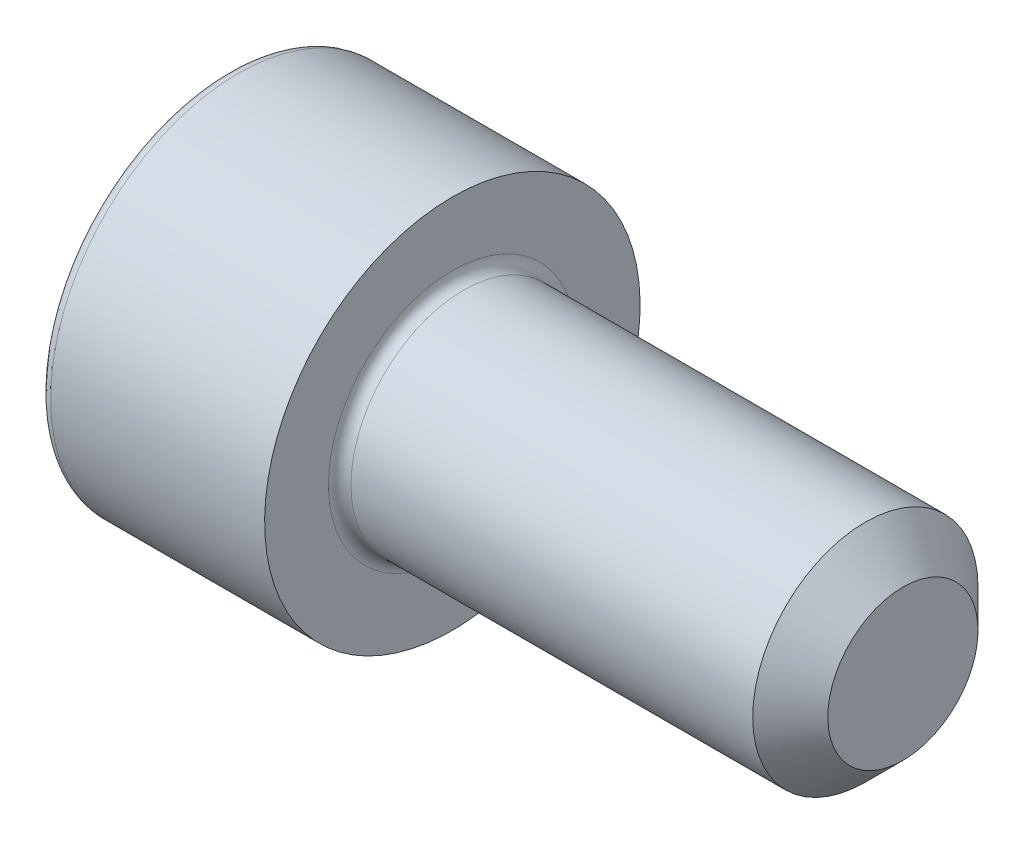
ISO-10303-21;
HEADER;
FILE_DESCRIPTION(('STEP AP214'),'2;1');
FILE_NAME('part.step','',(''),(''),'','','');
FILE_SCHEMA(('AUTOMOTIVE_DESIGN { 1 0 10303 214 1 1 1 1 }'));
ENDSEC;
DATA;
#1=APPLICATION_CONTEXT('core data for automotive mechanical design processes');
#2=APPLICATION_PROTOCOL_DEFINITION('international standard','automotive_design',2000,#1);
#3=PRODUCT_CONTEXT('',#1,'mechanical');
#4=PRODUCT('Part','Part','',(#3));
#5=PRODUCT_RELATED_PRODUCT_CATEGORY('part','',(#4));
#6=PRODUCT_DEFINITION_FORMATION('','',#4);
#7=PRODUCT_DEFINITION_CONTEXT('part definition',#1,'design');
#8=PRODUCT_DEFINITION('design','',#6,#7);
#9=PRODUCT_DEFINITION_SHAPE('','',#8);
#10=(LENGTH_UNIT() NAMED_UNIT(*) SI_UNIT(.MILLI.,.METRE.));
#11=(NAMED_UNIT(*) PLANE_ANGLE_UNIT() SI_UNIT($,.RADIAN.));
#12=(NAMED_UNIT(*) SI_UNIT($,.STERADIAN.) SOLID_ANGLE_UNIT());
#13=UNCERTAINTY_MEASURE_WITH_UNIT(LENGTH_MEASURE(1.E-05),#10,'distance_accuracy_value','');
#14=(GEOMETRIC_REPRESENTATION_CONTEXT(3) GLOBAL_UNCERTAINTY_ASSIGNED_CONTEXT((#13)) GLOBAL_UNIT_ASSIGNED_CONTEXT((#10,
#11,#12)) REPRESENTATION_CONTEXT('',''));
#15=CARTESIAN_POINT('',(0.,0.,0.));
#16=DIRECTION('',(0.,0.,1.));
#17=DIRECTION('',(1.,0.,0.));
#18=AXIS2_PLACEMENT_3D('',#15,#16,#17);
#19=CARTESIAN_POINT('',(0.,0.,0.));
#20=DIRECTION('',(-1.,0.,0.));
#21=DIRECTION('',(0.,-1.,0.));
#22=AXIS2_PLACEMENT_3D('',#19,#20,#21);
#23=PLANE('',#22);
#24=CARTESIAN_POINT('',(0.,0.,0.));
#25=DIRECTION('',(-1.,0.,0.));
#26=DIRECTION('',(0.,-1.,0.));
#27=AXIS2_PLACEMENT_3D('',#24,#25,#26);
#28=CIRCLE('',#27,4.7);
#29=CARTESIAN_POINT('',(0.,-4.7,0.));
#30=VERTEX_POINT('',#29);
#31=EDGE_CURVE('E158',#30,#30,#28,.T.);
#32=ORIENTED_EDGE('',*,*,#31,.T.);
#33=EDGE_LOOP('',(#32));
#34=FACE_BOUND('',#33,.T.);
#35=DIRECTION('',(0.,0.,-1.));
#36=VECTOR('',#35,1.);
#37=CARTESIAN_POINT('',(0.,2.5,1.44337567297407));
#38=LINE('',#37,#36);
#39=CARTESIAN_POINT('',(0.,2.5,1.44337567297407));
#40=VERTEX_POINT('',#39);
#41=CARTESIAN_POINT('',(0.,2.5,-1.44337567297406));
#42=VERTEX_POINT('',#41);
#43=EDGE_CURVE('E54',#40,#42,#38,.T.);
#44=ORIENTED_EDGE('',*,*,#43,.F.);
#45=DIRECTION('',(0.,0.866025403784439,-0.5));
#46=VECTOR('',#45,1.);
#47=CARTESIAN_POINT('',(0.,0.,2.88675134594813));
#48=LINE('',#47,#46);
#49=CARTESIAN_POINT('',(0.,0.,2.88675134594813));
#50=VERTEX_POINT('',#49);
#51=EDGE_CURVE('E137',#50,#40,#48,.T.);
#52=ORIENTED_EDGE('',*,*,#51,.F.);
#53=DIRECTION('',(0.,0.866025403784439,0.5));
#54=VECTOR('',#53,1.);
#55=CARTESIAN_POINT('',(0.,-2.5,1.44337567297406));
#56=LINE('',#55,#54);
#57=CARTESIAN_POINT('',(0.,-2.5,1.44337567297406));
#58=VERTEX_POINT('',#57);
#59=EDGE_CURVE('E135',#58,#50,#56,.T.);
#60=ORIENTED_EDGE('',*,*,#59,.F.);
#61=DIRECTION('',(0.,0.,1.));
#62=VECTOR('',#61,1.);
#63=CARTESIAN_POINT('',(0.,-2.5,-1.44337567297407));
#64=LINE('',#63,#62);
#65=CARTESIAN_POINT('',(0.,-2.5,-1.44337567297407));
#66=VERTEX_POINT('',#65);
#67=EDGE_CURVE('E102',#66,#58,#64,.T.);
#68=ORIENTED_EDGE('',*,*,#67,.F.);
#69=DIRECTION('',(0.,-0.866025403784439,0.5));
#70=VECTOR('',#69,1.);
#71=CARTESIAN_POINT('',(0.,0.,-2.88675134594813));
#72=LINE('',#71,#70);
#73=CARTESIAN_POINT('',(0.,0.,-2.88675134594813));
#74=VERTEX_POINT('',#73);
#75=EDGE_CURVE('E131',#74,#66,#72,.T.);
#76=ORIENTED_EDGE('',*,*,#75,.F.);
#77=DIRECTION('',(0.,-0.866025403784439,-0.5));
#78=VECTOR('',#77,1.);
#79=CARTESIAN_POINT('',(0.,2.5,-1.44337567297406));
#80=LINE('',#79,#78);
#81=EDGE_CURVE('E128',#42,#74,#80,.T.);
#82=ORIENTED_EDGE('',*,*,#81,.F.);
#83=EDGE_LOOP('',(#44,#52,#60,#68,#76,#82));
#84=FACE_BOUND('',#83,.T.);
#85=ADVANCED_FACE('F38',(#34,#84),#23,.T.);
#86=CARTESIAN_POINT('',(18.,0.,0.));
#87=DIRECTION('',(1.,0.,0.));
#88=DIRECTION('',(0.,1.,0.));
#89=AXIS2_PLACEMENT_3D('',#86,#87,#88);
#90=CYLINDRICAL_SURFACE('',#89,5.);
#91=CARTESIAN_POINT('',(0.300000000000002,0.,0.));
#92=DIRECTION('',(-1.,0.,0.));
#93=DIRECTION('',(0.,-1.,0.));
#94=AXIS2_PLACEMENT_3D('',#91,#92,#93);
#95=CIRCLE('',#94,5.);
#96=CARTESIAN_POINT('',(0.300000000000002,-5.,0.));
#97=VERTEX_POINT('',#96);
#98=EDGE_CURVE('E155',#97,#97,#95,.F.);
#99=ORIENTED_EDGE('',*,*,#98,.T.);
#100=EDGE_LOOP('',(#99));
#101=FACE_BOUND('',#100,.T.);
#102=CARTESIAN_POINT('',(6.,0.,0.));
#103=DIRECTION('',(1.,0.,0.));
#104=DIRECTION('',(0.,1.,0.));
#105=AXIS2_PLACEMENT_3D('',#102,#103,#104);
#106=CIRCLE('',#105,5.);
#107=CARTESIAN_POINT('',(6.,5.,0.));
#108=VERTEX_POINT('',#107);
#109=EDGE_CURVE('E141',#108,#108,#106,.T.);
#110=ORIENTED_EDGE('',*,*,#109,.F.);
#111=EDGE_LOOP('',(#110));
#112=FACE_BOUND('',#111,.T.);
#113=ADVANCED_FACE('F175',(#101,#112),#90,.T.);
#114=CARTESIAN_POINT('',(6.,5.,0.));
#115=DIRECTION('',(1.,0.,0.));
#116=DIRECTION('',(0.,1.,0.));
#117=AXIS2_PLACEMENT_3D('',#114,#115,#116);
#118=PLANE('',#117);
#119=CARTESIAN_POINT('',(6.,0.,0.));
#120=DIRECTION('',(1.,0.,0.));
#121=DIRECTION('',(0.,1.,0.));
#122=AXIS2_PLACEMENT_3D('',#119,#120,#121);
#123=CIRCLE('',#122,3.3);
#124=CARTESIAN_POINT('',(6.,3.3,0.));
#125=VERTEX_POINT('',#124);
#126=EDGE_CURVE('E152',#125,#125,#123,.F.);
#127=ORIENTED_EDGE('',*,*,#126,.T.);
#128=EDGE_LOOP('',(#127));
#129=FACE_BOUND('',#128,.T.);
#130=ORIENTED_EDGE('',*,*,#109,.T.);
#131=EDGE_LOOP('',(#130));
#132=FACE_BOUND('',#131,.T.);
#133=ADVANCED_FACE('F181',(#129,#132),#118,.T.);
#134=CARTESIAN_POINT('',(18.,0.,0.));
#135=DIRECTION('',(1.,0.,0.));
#136=DIRECTION('',(0.,1.,0.));
#137=AXIS2_PLACEMENT_3D('',#134,#135,#136);
#138=CYLINDRICAL_SURFACE('',#137,3.);
#139=CARTESIAN_POINT('',(17.,0.,0.));
#140=DIRECTION('',(1.,0.,0.));
#141=DIRECTION('',(0.,1.,0.));
#142=AXIS2_PLACEMENT_3D('',#139,#140,#141);
#143=CIRCLE('',#142,3.);
#144=CARTESIAN_POINT('',(17.,3.,0.));
#145=VERTEX_POINT('',#144);
#146=EDGE_CURVE('E11',#145,#145,#143,.F.);
#147=ORIENTED_EDGE('',*,*,#146,.T.);
#148=EDGE_LOOP('',(#147));
#149=FACE_BOUND('',#148,.T.);
#150=CARTESIAN_POINT('',(6.3,0.,0.));
#151=DIRECTION('',(1.,0.,0.));
#152=DIRECTION('',(0.,1.,0.));
#153=AXIS2_PLACEMENT_3D('',#150,#151,#152);
#154=CIRCLE('',#153,3.);
#155=CARTESIAN_POINT('',(6.3,3.,0.));
#156=VERTEX_POINT('',#155);
#157=EDGE_CURVE('E149',#156,#156,#154,.T.);
#158=ORIENTED_EDGE('',*,*,#157,.T.);
#159=EDGE_LOOP('',(#158));
#160=FACE_BOUND('',#159,.T.);
#161=ADVANCED_FACE('F198',(#149,#160),#138,.T.);
#162=CARTESIAN_POINT('',(18.,3.,0.));
#163=DIRECTION('',(1.,0.,0.));
#164=DIRECTION('',(0.,1.,0.));
#165=AXIS2_PLACEMENT_3D('',#162,#163,#164);
#166=PLANE('',#165);
#167=CARTESIAN_POINT('',(18.,0.,0.));
#168=DIRECTION('',(1.,0.,0.));
#169=DIRECTION('',(0.,1.,0.));
#170=AXIS2_PLACEMENT_3D('',#167,#168,#169);
#171=CIRCLE('',#170,1.99999999999999);
#172=CARTESIAN_POINT('',(18.,2.,0.));
#173=VERTEX_POINT('',#172);
#174=EDGE_CURVE('E47',#173,#173,#171,.T.);
#175=ORIENTED_EDGE('',*,*,#174,.T.);
#176=EDGE_LOOP('',(#175));
#177=FACE_BOUND('',#176,.T.);
#178=ADVANCED_FACE('F163',(#177),#166,.T.);
#179=CARTESIAN_POINT('',(2.5,2.5,1.44337567297407));
#180=DIRECTION('',(0.,1.,0.));
#181=DIRECTION('',(-1.,0.,0.));
#182=AXIS2_PLACEMENT_3D('',#179,#180,#181);
#183=PLANE('',#182);
#184=ORIENTED_EDGE('',*,*,#43,.T.);
#185=DIRECTION('',(-1.,0.,0.));
#186=VECTOR('',#185,1.);
#187=CARTESIAN_POINT('',(2.5,2.5,-1.44337567297406));
#188=LINE('',#187,#186);
#189=CARTESIAN_POINT('',(2.5,2.5,-1.44337567297406));
#190=VERTEX_POINT('',#189);
#191=EDGE_CURVE('E84',#190,#42,#188,.T.);
#192=ORIENTED_EDGE('',*,*,#191,.F.);
#193=DIRECTION('',(0.,0.,-1.));
#194=VECTOR('',#193,1.);
#195=CARTESIAN_POINT('',(2.5,2.5,1.44337567297407));
#196=LINE('',#195,#194);
#197=CARTESIAN_POINT('',(2.5,2.5,1.44337567297407));
#198=VERTEX_POINT('',#197);
#199=EDGE_CURVE('E139',#198,#190,#196,.T.);
#200=ORIENTED_EDGE('',*,*,#199,.F.);
#201=DIRECTION('',(-1.,0.,0.));
#202=VECTOR('',#201,1.);
#203=CARTESIAN_POINT('',(2.5,2.5,1.44337567297407));
#204=LINE('',#203,#202);
#205=EDGE_CURVE('E62',#198,#40,#204,.T.);
#206=ORIENTED_EDGE('',*,*,#205,.T.);
#207=EDGE_LOOP('',(#184,#192,#200,#206));
#208=FACE_BOUND('',#207,.T.);
#209=ADVANCED_FACE('F206',(#208),#183,.F.);
#210=CARTESIAN_POINT('',(2.5,0.,2.88675134594813));
#211=DIRECTION('',(0.,0.5,0.866025403784439));
#212=DIRECTION('',(0.,-0.866025403784439,0.5));
#213=AXIS2_PLACEMENT_3D('',#210,#211,#212);
#214=PLANE('',#213);
#215=ORIENTED_EDGE('',*,*,#51,.T.);
#216=ORIENTED_EDGE('',*,*,#205,.F.);
#217=DIRECTION('',(0.,0.866025403784439,-0.5));
#218=VECTOR('',#217,1.);
#219=CARTESIAN_POINT('',(2.5,0.,2.88675134594813));
#220=LINE('',#219,#218);
#221=CARTESIAN_POINT('',(2.5,0.,2.88675134594813));
#222=VERTEX_POINT('',#221);
#223=EDGE_CURVE('E114',#222,#198,#220,.T.);
#224=ORIENTED_EDGE('',*,*,#223,.F.);
#225=DIRECTION('',(-1.,0.,0.));
#226=VECTOR('',#225,1.);
#227=CARTESIAN_POINT('',(2.5,0.,2.88675134594813));
#228=LINE('',#227,#226);
#229=EDGE_CURVE('E106',#222,#50,#228,.T.);
#230=ORIENTED_EDGE('',*,*,#229,.T.);
#231=EDGE_LOOP('',(#215,#216,#224,#230));
#232=FACE_BOUND('',#231,.T.);
#233=ADVANCED_FACE('F212',(#232),#214,.F.);
#234=CARTESIAN_POINT('',(2.5,-2.5,1.44337567297406));
#235=DIRECTION('',(0.,-0.5,0.866025403784439));
#236=DIRECTION('',(0.,-0.866025403784439,-0.5));
#237=AXIS2_PLACEMENT_3D('',#234,#235,#236);
#238=PLANE('',#237);
#239=ORIENTED_EDGE('',*,*,#59,.T.);
#240=ORIENTED_EDGE('',*,*,#229,.F.);
#241=DIRECTION('',(0.,0.866025403784439,0.5));
#242=VECTOR('',#241,1.);
#243=CARTESIAN_POINT('',(2.5,-2.5,1.44337567297406));
#244=LINE('',#243,#242);
#245=CARTESIAN_POINT('',(2.5,-2.5,1.44337567297406));
#246=VERTEX_POINT('',#245);
#247=EDGE_CURVE('E110',#246,#222,#244,.T.);
#248=ORIENTED_EDGE('',*,*,#247,.F.);
#249=DIRECTION('',(-1.,0.,0.));
#250=VECTOR('',#249,1.);
#251=CARTESIAN_POINT('',(2.5,-2.5,1.44337567297406));
#252=LINE('',#251,#250);
#253=EDGE_CURVE('E95',#246,#58,#252,.T.);
#254=ORIENTED_EDGE('',*,*,#253,.T.);
#255=EDGE_LOOP('',(#239,#240,#248,#254));
#256=FACE_BOUND('',#255,.T.);
#257=ADVANCED_FACE('F111',(#256),#238,.F.);
#258=CARTESIAN_POINT('',(2.5,-2.5,-1.44337567297407));
#259=DIRECTION('',(0.,-1.,0.));
#260=DIRECTION('',(1.,0.,0.));
#261=AXIS2_PLACEMENT_3D('',#258,#259,#260);
#262=PLANE('',#261);
#263=ORIENTED_EDGE('',*,*,#67,.T.);
#264=ORIENTED_EDGE('',*,*,#253,.F.);
#265=DIRECTION('',(0.,0.,1.));
#266=VECTOR('',#265,1.);
#267=CARTESIAN_POINT('',(2.5,-2.5,-1.44337567297407));
#268=LINE('',#267,#266);
#269=CARTESIAN_POINT('',(2.5,-2.5,-1.44337567297407));
#270=VERTEX_POINT('',#269);
#271=EDGE_CURVE('E99',#270,#246,#268,.T.);
#272=ORIENTED_EDGE('',*,*,#271,.F.);
#273=DIRECTION('',(-1.,0.,0.));
#274=VECTOR('',#273,1.);
#275=CARTESIAN_POINT('',(2.5,-2.5,-1.44337567297407));
#276=LINE('',#275,#274);
#277=EDGE_CURVE('E107',#270,#66,#276,.T.);
#278=ORIENTED_EDGE('',*,*,#277,.T.);
#279=EDGE_LOOP('',(#263,#264,#272,#278));
#280=FACE_BOUND('',#279,.T.);
#281=ADVANCED_FACE('F97',(#280),#262,.F.);
#282=CARTESIAN_POINT('',(2.5,0.,-2.88675134594813));
#283=DIRECTION('',(0.,-0.5,-0.866025403784439));
#284=DIRECTION('',(0.,0.866025403784439,-0.5));
#285=AXIS2_PLACEMENT_3D('',#282,#283,#284);
#286=PLANE('',#285);
#287=ORIENTED_EDGE('',*,*,#75,.T.);
#288=ORIENTED_EDGE('',*,*,#277,.F.);
#289=DIRECTION('',(0.,-0.866025403784439,0.5));
#290=VECTOR('',#289,1.);
#291=CARTESIAN_POINT('',(2.5,0.,-2.88675134594813));
#292=LINE('',#291,#290);
#293=CARTESIAN_POINT('',(2.5,0.,-2.88675134594813));
#294=VERTEX_POINT('',#293);
#295=EDGE_CURVE('E120',#294,#270,#292,.T.);
#296=ORIENTED_EDGE('',*,*,#295,.F.);
#297=DIRECTION('',(-1.,0.,0.));
#298=VECTOR('',#297,1.);
#299=CARTESIAN_POINT('',(2.5,0.,-2.88675134594813));
#300=LINE('',#299,#298);
#301=EDGE_CURVE('E144',#294,#74,#300,.T.);
#302=ORIENTED_EDGE('',*,*,#301,.T.);
#303=EDGE_LOOP('',(#287,#288,#296,#302));
#304=FACE_BOUND('',#303,.T.);
#305=ADVANCED_FACE('F215',(#304),#286,.F.);
#306=CARTESIAN_POINT('',(2.5,2.5,-1.44337567297406));
#307=DIRECTION('',(0.,0.5,-0.866025403784439));
#308=DIRECTION('',(0.,0.866025403784439,0.5));
#309=AXIS2_PLACEMENT_3D('',#306,#307,#308);
#310=PLANE('',#309);
#311=ORIENTED_EDGE('',*,*,#81,.T.);
#312=ORIENTED_EDGE('',*,*,#301,.F.);
#313=DIRECTION('',(0.,-0.866025403784439,-0.5));
#314=VECTOR('',#313,1.);
#315=CARTESIAN_POINT('',(2.5,2.5,-1.44337567297406));
#316=LINE('',#315,#314);
#317=EDGE_CURVE('E122',#190,#294,#316,.T.);
#318=ORIENTED_EDGE('',*,*,#317,.F.);
#319=ORIENTED_EDGE('',*,*,#191,.T.);
#320=EDGE_LOOP('',(#311,#312,#318,#319));
#321=FACE_BOUND('',#320,.T.);
#322=ADVANCED_FACE('F192',(#321),#310,.F.);
#323=CARTESIAN_POINT('',(2.5,0.,0.));
#324=DIRECTION('',(-1.,0.,0.));
#325=DIRECTION('',(0.,-1.,0.));
#326=AXIS2_PLACEMENT_3D('',#323,#324,#325);
#327=PLANE('',#326);
#328=ORIENTED_EDGE('',*,*,#199,.T.);
#329=ORIENTED_EDGE('',*,*,#317,.T.);
#330=ORIENTED_EDGE('',*,*,#295,.T.);
#331=ORIENTED_EDGE('',*,*,#271,.T.);
#332=ORIENTED_EDGE('',*,*,#247,.T.);
#333=ORIENTED_EDGE('',*,*,#223,.T.);
#334=EDGE_LOOP('',(#328,#329,#330,#331,#332,#333));
#335=FACE_BOUND('',#334,.T.);
#336=ADVANCED_FACE('F117',(#335),#327,.T.);
#337=CARTESIAN_POINT('',(6.3,0.,0.));
#338=DIRECTION('',(1.,0.,0.));
#339=DIRECTION('',(0.,1.,0.));
#340=AXIS2_PLACEMENT_3D('',#337,#338,#339);
#341=TOROIDAL_SURFACE('',#340,3.3,0.3);
#342=ORIENTED_EDGE('',*,*,#126,.F.);
#343=EDGE_LOOP('',(#342));
#344=FACE_BOUND('',#343,.T.);
#345=ORIENTED_EDGE('',*,*,#157,.F.);
#346=EDGE_LOOP('',(#345));
#347=FACE_BOUND('',#346,.T.);
#348=ADVANCED_FACE('F171',(#344,#347),#341,.F.);
#349=CARTESIAN_POINT('',(0.300000000000002,0.,0.));
#350=DIRECTION('',(-1.,0.,0.));
#351=DIRECTION('',(0.,-1.,0.));
#352=AXIS2_PLACEMENT_3D('',#349,#350,#351);
#353=TOROIDAL_SURFACE('',#352,4.7,0.3);
#354=ORIENTED_EDGE('',*,*,#31,.F.);
#355=EDGE_LOOP('',(#354));
#356=FACE_BOUND('',#355,.T.);
#357=ORIENTED_EDGE('',*,*,#98,.F.);
#358=EDGE_LOOP('',(#357));
#359=FACE_BOUND('',#358,.T.);
#360=ADVANCED_FACE('F166',(#356,#359),#353,.T.);
#361=CARTESIAN_POINT('',(18.,0.,0.));
#362=DIRECTION('',(-1.,0.,0.));
#363=DIRECTION('',(0.,-1.,0.));
#364=AXIS2_PLACEMENT_3D('',#361,#362,#363);
#365=CONICAL_SURFACE('',#364,1.99999999999999,0.785398163397447);
#366=ORIENTED_EDGE('',*,*,#146,.F.);
#367=EDGE_LOOP('',(#366));
#368=FACE_BOUND('',#367,.T.);
#369=ORIENTED_EDGE('',*,*,#174,.F.);
#370=EDGE_LOOP('',(#369));
#371=FACE_BOUND('',#370,.T.);
#372=ADVANCED_FACE('F41',(#368,#371),#365,.T.);
#373=CLOSED_SHELL('',(#85,#113,#133,#161,#178,#209,#233,#257,#281,#305,#322,#336,#348,#360,#372));
#374=MANIFOLD_SOLID_BREP('B2',#373);
#375=ADVANCED_BREP_SHAPE_REPRESENTATION('',(#18,#374),#14);
#376=SHAPE_DEFINITION_REPRESENTATION(#9,#375);
ENDSEC;
END-ISO-10303-21;
